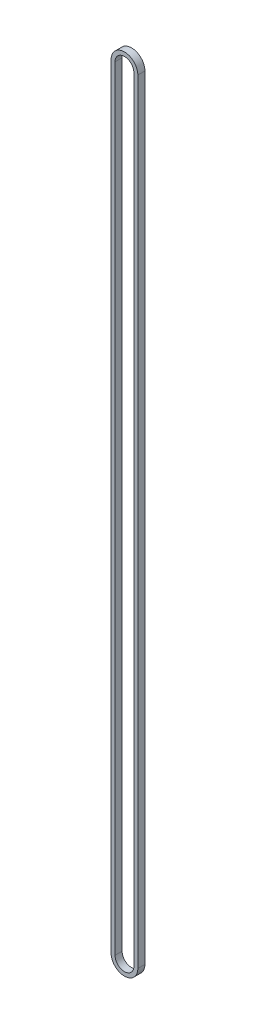
ISO-10303-21;
HEADER;
FILE_DESCRIPTION(('STEP AP214'),'2;1');
FILE_NAME('part.step','',(''),(''),'','','');
FILE_SCHEMA(('AUTOMOTIVE_DESIGN { 1 0 10303 214 1 1 1 1 }'));
ENDSEC;
DATA;
#1=APPLICATION_CONTEXT('core data for automotive mechanical design processes');
#2=APPLICATION_PROTOCOL_DEFINITION('international standard','automotive_design',2000,#1);
#3=PRODUCT_CONTEXT('',#1,'mechanical');
#4=PRODUCT('Part','Part','',(#3));
#5=PRODUCT_RELATED_PRODUCT_CATEGORY('part','',(#4));
#6=PRODUCT_DEFINITION_FORMATION('','',#4);
#7=PRODUCT_DEFINITION_CONTEXT('part definition',#1,'design');
#8=PRODUCT_DEFINITION('design','',#6,#7);
#9=PRODUCT_DEFINITION_SHAPE('','',#8);
#10=(LENGTH_UNIT() NAMED_UNIT(*) SI_UNIT(.MILLI.,.METRE.));
#11=(NAMED_UNIT(*) PLANE_ANGLE_UNIT() SI_UNIT($,.RADIAN.));
#12=(NAMED_UNIT(*) SI_UNIT($,.STERADIAN.) SOLID_ANGLE_UNIT());
#13=UNCERTAINTY_MEASURE_WITH_UNIT(LENGTH_MEASURE(1.E-05),#10,'distance_accuracy_value','');
#14=(GEOMETRIC_REPRESENTATION_CONTEXT(3) GLOBAL_UNCERTAINTY_ASSIGNED_CONTEXT((#13)) GLOBAL_UNIT_ASSIGNED_CONTEXT((#10,
#11,#12)) REPRESENTATION_CONTEXT('',''));
#15=CARTESIAN_POINT('',(0.,0.,0.));
#16=DIRECTION('',(0.,0.,1.));
#17=DIRECTION('',(1.,0.,0.));
#18=AXIS2_PLACEMENT_3D('',#15,#16,#17);
#19=CARTESIAN_POINT('',(0.,-245.925,4.5));
#20=DIRECTION('',(0.,0.,1.));
#21=DIRECTION('',(1.,0.,0.));
#22=AXIS2_PLACEMENT_3D('',#19,#20,#21);
#23=PLANE('',#22);
#24=CARTESIAN_POINT('',(0.,-245.925,4.5));
#25=DIRECTION('',(0.,0.,1.));
#26=DIRECTION('',(1.,0.,0.));
#27=AXIS2_PLACEMENT_3D('',#24,#25,#26);
#28=CIRCLE('',#27,8.5);
#29=CARTESIAN_POINT('',(-8.5,-245.925,4.5));
#30=VERTEX_POINT('',#29);
#31=CARTESIAN_POINT('',(8.5,-245.925,4.5));
#32=VERTEX_POINT('',#31);
#33=EDGE_CURVE('E136',#30,#32,#28,.T.);
#34=ORIENTED_EDGE('',*,*,#33,.T.);
#35=DIRECTION('',(0.,1.,0.));
#36=VECTOR('',#35,1.);
#37=CARTESIAN_POINT('',(8.5,-245.925,4.5));
#38=LINE('',#37,#36);
#39=CARTESIAN_POINT('',(8.49999999999991,245.925,4.5));
#40=VERTEX_POINT('',#39);
#41=EDGE_CURVE('E139',#32,#40,#38,.T.);
#42=ORIENTED_EDGE('',*,*,#41,.T.);
#43=CARTESIAN_POINT('',(0.,245.925,4.5));
#44=DIRECTION('',(0.,0.,1.));
#45=DIRECTION('',(1.,0.,0.));
#46=AXIS2_PLACEMENT_3D('',#43,#44,#45);
#47=CIRCLE('',#46,8.5);
#48=CARTESIAN_POINT('',(-8.5,245.925,4.5));
#49=VERTEX_POINT('',#48);
#50=EDGE_CURVE('E142',#40,#49,#47,.T.);
#51=ORIENTED_EDGE('',*,*,#50,.T.);
#52=DIRECTION('',(0.,-1.,0.));
#53=VECTOR('',#52,1.);
#54=CARTESIAN_POINT('',(-8.5,-245.925,4.5));
#55=LINE('',#54,#53);
#56=EDGE_CURVE('E144',#49,#30,#55,.T.);
#57=ORIENTED_EDGE('',*,*,#56,.T.);
#58=EDGE_LOOP('',(#34,#42,#51,#57));
#59=FACE_BOUND('',#58,.T.);
#60=DIRECTION('',(0.,1.,0.));
#61=VECTOR('',#60,1.);
#62=CARTESIAN_POINT('',(6.,-245.925,4.5));
#63=LINE('',#62,#61);
#64=CARTESIAN_POINT('',(6.,-245.925,4.5));
#65=VERTEX_POINT('',#64);
#66=CARTESIAN_POINT('',(5.99999999999991,245.925,4.5));
#67=VERTEX_POINT('',#66);
#68=EDGE_CURVE('E108',#65,#67,#63,.T.);
#69=ORIENTED_EDGE('',*,*,#68,.F.);
#70=CARTESIAN_POINT('',(0.,-245.925,4.5));
#71=DIRECTION('',(0.,0.,1.));
#72=DIRECTION('',(1.,0.,0.));
#73=AXIS2_PLACEMENT_3D('',#70,#71,#72);
#74=CIRCLE('',#73,6.);
#75=CARTESIAN_POINT('',(-6.,-245.925,4.5));
#76=VERTEX_POINT('',#75);
#77=EDGE_CURVE('E100',#76,#65,#74,.T.);
#78=ORIENTED_EDGE('',*,*,#77,.F.);
#79=DIRECTION('',(0.,-1.,0.));
#80=VECTOR('',#79,1.);
#81=CARTESIAN_POINT('',(-6.,-245.925,4.5));
#82=LINE('',#81,#80);
#83=CARTESIAN_POINT('',(-6.,245.925,4.5));
#84=VERTEX_POINT('',#83);
#85=EDGE_CURVE('E122',#84,#76,#82,.T.);
#86=ORIENTED_EDGE('',*,*,#85,.F.);
#87=CARTESIAN_POINT('',(0.,245.925,4.5));
#88=DIRECTION('',(0.,0.,1.));
#89=DIRECTION('',(1.,0.,0.));
#90=AXIS2_PLACEMENT_3D('',#87,#88,#89);
#91=CIRCLE('',#90,6.);
#92=EDGE_CURVE('E120',#67,#84,#91,.T.);
#93=ORIENTED_EDGE('',*,*,#92,.F.);
#94=EDGE_LOOP('',(#69,#78,#86,#93));
#95=FACE_BOUND('',#94,.T.);
#96=ADVANCED_FACE('F35',(#59,#95),#23,.T.);
#97=CARTESIAN_POINT('',(0.,-245.925,0.));
#98=DIRECTION('',(0.,0.,1.));
#99=DIRECTION('',(1.,0.,0.));
#100=AXIS2_PLACEMENT_3D('',#97,#98,#99);
#101=PLANE('',#100);
#102=CARTESIAN_POINT('',(0.,-245.925,0.));
#103=DIRECTION('',(0.,0.,1.));
#104=DIRECTION('',(1.,0.,0.));
#105=AXIS2_PLACEMENT_3D('',#102,#103,#104);
#106=CIRCLE('',#105,8.5);
#107=CARTESIAN_POINT('',(-8.5,-245.925,0.));
#108=VERTEX_POINT('',#107);
#109=CARTESIAN_POINT('',(8.5,-245.925,0.));
#110=VERTEX_POINT('',#109);
#111=EDGE_CURVE('E116',#108,#110,#106,.T.);
#112=ORIENTED_EDGE('',*,*,#111,.F.);
#113=DIRECTION('',(0.,-1.,0.));
#114=VECTOR('',#113,1.);
#115=CARTESIAN_POINT('',(-8.5,-245.925,0.));
#116=LINE('',#115,#114);
#117=CARTESIAN_POINT('',(-8.5,245.925,0.));
#118=VERTEX_POINT('',#117);
#119=EDGE_CURVE('E140',#118,#108,#116,.T.);
#120=ORIENTED_EDGE('',*,*,#119,.F.);
#121=CARTESIAN_POINT('',(0.,245.925,0.));
#122=DIRECTION('',(0.,0.,1.));
#123=DIRECTION('',(1.,0.,0.));
#124=AXIS2_PLACEMENT_3D('',#121,#122,#123);
#125=CIRCLE('',#124,8.5);
#126=CARTESIAN_POINT('',(8.49999999999991,245.925,0.));
#127=VERTEX_POINT('',#126);
#128=EDGE_CURVE('E151',#127,#118,#125,.T.);
#129=ORIENTED_EDGE('',*,*,#128,.F.);
#130=DIRECTION('',(0.,1.,0.));
#131=VECTOR('',#130,1.);
#132=CARTESIAN_POINT('',(8.5,-245.925,0.));
#133=LINE('',#132,#131);
#134=EDGE_CURVE('E149',#110,#127,#133,.T.);
#135=ORIENTED_EDGE('',*,*,#134,.F.);
#136=EDGE_LOOP('',(#112,#120,#129,#135));
#137=FACE_BOUND('',#136,.T.);
#138=CARTESIAN_POINT('',(0.,-245.925,0.));
#139=DIRECTION('',(0.,0.,1.));
#140=DIRECTION('',(1.,0.,0.));
#141=AXIS2_PLACEMENT_3D('',#138,#139,#140);
#142=CIRCLE('',#141,6.);
#143=CARTESIAN_POINT('',(-6.,-245.925,0.));
#144=VERTEX_POINT('',#143);
#145=CARTESIAN_POINT('',(6.,-245.925,0.));
#146=VERTEX_POINT('',#145);
#147=EDGE_CURVE('E58',#144,#146,#142,.T.);
#148=ORIENTED_EDGE('',*,*,#147,.T.);
#149=DIRECTION('',(0.,1.,0.));
#150=VECTOR('',#149,1.);
#151=CARTESIAN_POINT('',(6.,-245.925,0.));
#152=LINE('',#151,#150);
#153=CARTESIAN_POINT('',(5.99999999999991,245.925,0.));
#154=VERTEX_POINT('',#153);
#155=EDGE_CURVE('E115',#146,#154,#152,.T.);
#156=ORIENTED_EDGE('',*,*,#155,.T.);
#157=CARTESIAN_POINT('',(0.,245.925,0.));
#158=DIRECTION('',(0.,0.,1.));
#159=DIRECTION('',(1.,0.,0.));
#160=AXIS2_PLACEMENT_3D('',#157,#158,#159);
#161=CIRCLE('',#160,6.);
#162=CARTESIAN_POINT('',(-6.,245.925,0.));
#163=VERTEX_POINT('',#162);
#164=EDGE_CURVE('E128',#154,#163,#161,.T.);
#165=ORIENTED_EDGE('',*,*,#164,.T.);
#166=DIRECTION('',(0.,-1.,0.));
#167=VECTOR('',#166,1.);
#168=CARTESIAN_POINT('',(-6.,-245.925,0.));
#169=LINE('',#168,#167);
#170=EDGE_CURVE('E109',#163,#144,#169,.T.);
#171=ORIENTED_EDGE('',*,*,#170,.T.);
#172=EDGE_LOOP('',(#148,#156,#165,#171));
#173=FACE_BOUND('',#172,.T.);
#174=ADVANCED_FACE('F169',(#137,#173),#101,.F.);
#175=CARTESIAN_POINT('',(0.,-245.925,4.5));
#176=DIRECTION('',(0.,0.,-1.));
#177=DIRECTION('',(-1.,0.,0.));
#178=AXIS2_PLACEMENT_3D('',#175,#176,#177);
#179=CYLINDRICAL_SURFACE('',#178,8.5);
#180=ORIENTED_EDGE('',*,*,#111,.T.);
#181=DIRECTION('',(0.,0.,-1.));
#182=VECTOR('',#181,1.);
#183=CARTESIAN_POINT('',(8.5,-245.925,4.5));
#184=LINE('',#183,#182);
#185=EDGE_CURVE('E11',#32,#110,#184,.T.);
#186=ORIENTED_EDGE('',*,*,#185,.F.);
#187=ORIENTED_EDGE('',*,*,#33,.F.);
#188=DIRECTION('',(0.,0.,-1.));
#189=VECTOR('',#188,1.);
#190=CARTESIAN_POINT('',(-8.5,-245.925,4.5));
#191=LINE('',#190,#189);
#192=EDGE_CURVE('E146',#30,#108,#191,.T.);
#193=ORIENTED_EDGE('',*,*,#192,.T.);
#194=EDGE_LOOP('',(#180,#186,#187,#193));
#195=FACE_BOUND('',#194,.T.);
#196=ADVANCED_FACE('F37',(#195),#179,.T.);
#197=CARTESIAN_POINT('',(8.5,-245.925,4.5));
#198=DIRECTION('',(-1.,0.,0.));
#199=DIRECTION('',(0.,0.,1.));
#200=AXIS2_PLACEMENT_3D('',#197,#198,#199);
#201=PLANE('',#200);
#202=ORIENTED_EDGE('',*,*,#134,.T.);
#203=DIRECTION('',(0.,0.,-1.));
#204=VECTOR('',#203,1.);
#205=CARTESIAN_POINT('',(8.49999999999991,245.925,4.5));
#206=LINE('',#205,#204);
#207=EDGE_CURVE('E43',#40,#127,#206,.T.);
#208=ORIENTED_EDGE('',*,*,#207,.F.);
#209=ORIENTED_EDGE('',*,*,#41,.F.);
#210=ORIENTED_EDGE('',*,*,#185,.T.);
#211=EDGE_LOOP('',(#202,#208,#209,#210));
#212=FACE_BOUND('',#211,.T.);
#213=ADVANCED_FACE('F179',(#212),#201,.F.);
#214=CARTESIAN_POINT('',(0.,245.925,4.5));
#215=DIRECTION('',(0.,0.,-1.));
#216=DIRECTION('',(-1.,0.,0.));
#217=AXIS2_PLACEMENT_3D('',#214,#215,#216);
#218=CYLINDRICAL_SURFACE('',#217,8.5);
#219=ORIENTED_EDGE('',*,*,#128,.T.);
#220=DIRECTION('',(0.,0.,-1.));
#221=VECTOR('',#220,1.);
#222=CARTESIAN_POINT('',(-8.5,245.925,4.5));
#223=LINE('',#222,#221);
#224=EDGE_CURVE('E156',#49,#118,#223,.T.);
#225=ORIENTED_EDGE('',*,*,#224,.F.);
#226=ORIENTED_EDGE('',*,*,#50,.F.);
#227=ORIENTED_EDGE('',*,*,#207,.T.);
#228=EDGE_LOOP('',(#219,#225,#226,#227));
#229=FACE_BOUND('',#228,.T.);
#230=ADVANCED_FACE('F163',(#229),#218,.T.);
#231=CARTESIAN_POINT('',(-8.5,-245.925,4.5));
#232=DIRECTION('',(1.,0.,0.));
#233=DIRECTION('',(0.,0.,-1.));
#234=AXIS2_PLACEMENT_3D('',#231,#232,#233);
#235=PLANE('',#234);
#236=ORIENTED_EDGE('',*,*,#119,.T.);
#237=ORIENTED_EDGE('',*,*,#192,.F.);
#238=ORIENTED_EDGE('',*,*,#56,.F.);
#239=ORIENTED_EDGE('',*,*,#224,.T.);
#240=EDGE_LOOP('',(#236,#237,#238,#239));
#241=FACE_BOUND('',#240,.T.);
#242=ADVANCED_FACE('F173',(#241),#235,.F.);
#243=CARTESIAN_POINT('',(0.,-245.925,4.5));
#244=DIRECTION('',(0.,0.,-1.));
#245=DIRECTION('',(-1.,0.,0.));
#246=AXIS2_PLACEMENT_3D('',#243,#244,#245);
#247=CYLINDRICAL_SURFACE('',#246,6.);
#248=ORIENTED_EDGE('',*,*,#147,.F.);
#249=DIRECTION('',(0.,0.,-1.));
#250=VECTOR('',#249,1.);
#251=CARTESIAN_POINT('',(-6.,-245.925,4.5));
#252=LINE('',#251,#250);
#253=EDGE_CURVE('E104',#76,#144,#252,.T.);
#254=ORIENTED_EDGE('',*,*,#253,.F.);
#255=ORIENTED_EDGE('',*,*,#77,.T.);
#256=DIRECTION('',(0.,0.,-1.));
#257=VECTOR('',#256,1.);
#258=CARTESIAN_POINT('',(6.,-245.925,4.5));
#259=LINE('',#258,#257);
#260=EDGE_CURVE('E103',#65,#146,#259,.T.);
#261=ORIENTED_EDGE('',*,*,#260,.T.);
#262=EDGE_LOOP('',(#248,#254,#255,#261));
#263=FACE_BOUND('',#262,.T.);
#264=ADVANCED_FACE('F102',(#263),#247,.F.);
#265=CARTESIAN_POINT('',(6.,-245.925,4.5));
#266=DIRECTION('',(-1.,0.,0.));
#267=DIRECTION('',(0.,-1.,0.));
#268=AXIS2_PLACEMENT_3D('',#265,#266,#267);
#269=PLANE('',#268);
#270=ORIENTED_EDGE('',*,*,#155,.F.);
#271=ORIENTED_EDGE('',*,*,#260,.F.);
#272=ORIENTED_EDGE('',*,*,#68,.T.);
#273=DIRECTION('',(0.,0.,-1.));
#274=VECTOR('',#273,1.);
#275=CARTESIAN_POINT('',(5.99999999999991,245.925,4.5));
#276=LINE('',#275,#274);
#277=EDGE_CURVE('E117',#67,#154,#276,.T.);
#278=ORIENTED_EDGE('',*,*,#277,.T.);
#279=EDGE_LOOP('',(#270,#271,#272,#278));
#280=FACE_BOUND('',#279,.T.);
#281=ADVANCED_FACE('F112',(#280),#269,.T.);
#282=CARTESIAN_POINT('',(0.,245.925,4.5));
#283=DIRECTION('',(0.,0.,-1.));
#284=DIRECTION('',(-1.,0.,0.));
#285=AXIS2_PLACEMENT_3D('',#282,#283,#284);
#286=CYLINDRICAL_SURFACE('',#285,6.);
#287=ORIENTED_EDGE('',*,*,#164,.F.);
#288=ORIENTED_EDGE('',*,*,#277,.F.);
#289=ORIENTED_EDGE('',*,*,#92,.T.);
#290=DIRECTION('',(0.,0.,-1.));
#291=VECTOR('',#290,1.);
#292=CARTESIAN_POINT('',(-6.,245.925,4.5));
#293=LINE('',#292,#291);
#294=EDGE_CURVE('E50',#84,#163,#293,.T.);
#295=ORIENTED_EDGE('',*,*,#294,.T.);
#296=EDGE_LOOP('',(#287,#288,#289,#295));
#297=FACE_BOUND('',#296,.T.);
#298=ADVANCED_FACE('F202',(#297),#286,.F.);
#299=CARTESIAN_POINT('',(-6.,-245.925,4.5));
#300=DIRECTION('',(1.,0.,0.));
#301=DIRECTION('',(0.,1.,0.));
#302=AXIS2_PLACEMENT_3D('',#299,#300,#301);
#303=PLANE('',#302);
#304=ORIENTED_EDGE('',*,*,#170,.F.);
#305=ORIENTED_EDGE('',*,*,#294,.F.);
#306=ORIENTED_EDGE('',*,*,#85,.T.);
#307=ORIENTED_EDGE('',*,*,#253,.T.);
#308=EDGE_LOOP('',(#304,#305,#306,#307));
#309=FACE_BOUND('',#308,.T.);
#310=ADVANCED_FACE('F206',(#309),#303,.T.);
#311=CLOSED_SHELL('',(#96,#174,#196,#213,#230,#242,#264,#281,#298,#310));
#312=MANIFOLD_SOLID_BREP('B2',#311);
#313=ADVANCED_BREP_SHAPE_REPRESENTATION('',(#18,#312),#14);
#314=SHAPE_DEFINITION_REPRESENTATION(#9,#313);
ENDSEC;
END-ISO-10303-21;
